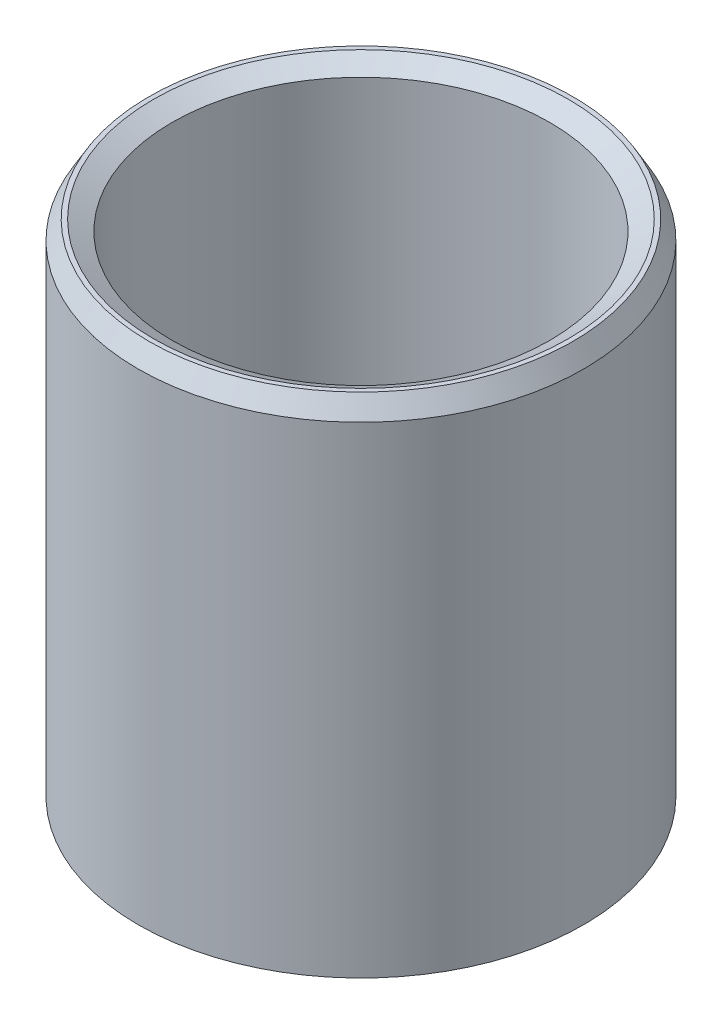
ISO-10303-21;
HEADER;
FILE_DESCRIPTION(('STEP AP214'),'2;1');
FILE_NAME('part.step','',(''),(''),'','','');
FILE_SCHEMA(('AUTOMOTIVE_DESIGN { 1 0 10303 214 1 1 1 1 }'));
ENDSEC;
DATA;
#1=APPLICATION_CONTEXT('core data for automotive mechanical design processes');
#2=APPLICATION_PROTOCOL_DEFINITION('international standard','automotive_design',2000,#1);
#3=PRODUCT_CONTEXT('',#1,'mechanical');
#4=PRODUCT('Part','Part','',(#3));
#5=PRODUCT_RELATED_PRODUCT_CATEGORY('part','',(#4));
#6=PRODUCT_DEFINITION_FORMATION('','',#4);
#7=PRODUCT_DEFINITION_CONTEXT('part definition',#1,'design');
#8=PRODUCT_DEFINITION('design','',#6,#7);
#9=PRODUCT_DEFINITION_SHAPE('','',#8);
#10=(LENGTH_UNIT() NAMED_UNIT(*) SI_UNIT(.MILLI.,.METRE.));
#11=(NAMED_UNIT(*) PLANE_ANGLE_UNIT() SI_UNIT($,.RADIAN.));
#12=(NAMED_UNIT(*) SI_UNIT($,.STERADIAN.) SOLID_ANGLE_UNIT());
#13=UNCERTAINTY_MEASURE_WITH_UNIT(LENGTH_MEASURE(1.E-05),#10,'distance_accuracy_value','');
#14=(GEOMETRIC_REPRESENTATION_CONTEXT(3) GLOBAL_UNCERTAINTY_ASSIGNED_CONTEXT((#13)) GLOBAL_UNIT_ASSIGNED_CONTEXT((#10,
#11,#12)) REPRESENTATION_CONTEXT('',''));
#15=CARTESIAN_POINT('',(0.,0.,0.));
#16=DIRECTION('',(0.,0.,1.));
#17=DIRECTION('',(1.,0.,0.));
#18=AXIS2_PLACEMENT_3D('',#15,#16,#17);
#19=CARTESIAN_POINT('',(0.,97.4390811008619,0.));
#20=DIRECTION('',(0.,-1.,0.));
#21=DIRECTION('',(0.,0.,-1.));
#22=AXIS2_PLACEMENT_3D('',#19,#20,#21);
#23=CYLINDRICAL_SURFACE('',#22,42.5);
#24=CARTESIAN_POINT('',(0.,2.04772689458219,0.));
#25=DIRECTION('',(0.,1.,0.));
#26=DIRECTION('',(0.,0.,1.));
#27=AXIS2_PLACEMENT_3D('',#24,#25,#26);
#28=CIRCLE('',#27,42.5);
#29=CARTESIAN_POINT('',(0.,2.04772689458219,42.5));
#30=VERTEX_POINT('',#29);
#31=EDGE_CURVE('E10',#30,#30,#28,.T.);
#32=ORIENTED_EDGE('',*,*,#31,.T.);
#33=EDGE_LOOP('',(#32));
#34=FACE_BOUND('',#33,.T.);
#35=CARTESIAN_POINT('',(0.,93.8923140794203,0.));
#36=DIRECTION('',(0.,1.,0.));
#37=DIRECTION('',(0.,0.,1.));
#38=AXIS2_PLACEMENT_3D('',#35,#36,#37);
#39=CIRCLE('',#38,42.5);
#40=CARTESIAN_POINT('',(0.,93.8923140794203,42.5));
#41=VERTEX_POINT('',#40);
#42=EDGE_CURVE('E50',#41,#41,#39,.F.);
#43=ORIENTED_EDGE('',*,*,#42,.T.);
#44=EDGE_LOOP('',(#43));
#45=FACE_BOUND('',#44,.T.);
#46=ADVANCED_FACE('F39',(#34,#45),#23,.T.);
#47=CARTESIAN_POINT('',(0.,97.4390811008619,0.));
#48=DIRECTION('',(0.,1.,0.));
#49=DIRECTION('',(0.,0.,1.));
#50=AXIS2_PLACEMENT_3D('',#47,#48,#49);
#51=PLANE('',#50);
#52=CARTESIAN_POINT('',(0.,97.4390811008619,0.));
#53=DIRECTION('',(0.,1.,0.));
#54=DIRECTION('',(0.,0.,1.));
#55=AXIS2_PLACEMENT_3D('',#52,#53,#54);
#56=CIRCLE('',#55,39.5839253291137);
#57=CARTESIAN_POINT('',(0.,97.4390811008619,39.5839253291137));
#58=VERTEX_POINT('',#57);
#59=EDGE_CURVE('E58',#58,#58,#56,.F.);
#60=ORIENTED_EDGE('',*,*,#59,.T.);
#61=EDGE_LOOP('',(#60));
#62=FACE_BOUND('',#61,.T.);
#63=CARTESIAN_POINT('',(0.,97.4390811008619,0.));
#64=DIRECTION('',(0.,1.,0.));
#65=DIRECTION('',(0.,0.,1.));
#66=AXIS2_PLACEMENT_3D('',#63,#64,#65);
#67=CIRCLE('',#66,40.4522731054179);
#68=CARTESIAN_POINT('',(0.,97.4390811008619,40.4522731054179));
#69=VERTEX_POINT('',#68);
#70=EDGE_CURVE('E61',#69,#69,#67,.T.);
#71=ORIENTED_EDGE('',*,*,#70,.T.);
#72=EDGE_LOOP('',(#71));
#73=FACE_BOUND('',#72,.T.);
#74=ADVANCED_FACE('F88',(#62,#73),#51,.T.);
#75=CARTESIAN_POINT('',(0.,0.,0.));
#76=DIRECTION('',(0.,1.,0.));
#77=DIRECTION('',(0.,0.,1.));
#78=AXIS2_PLACEMENT_3D('',#75,#76,#77);
#79=PLANE('',#78);
#80=CARTESIAN_POINT('',(0.,0.,0.));
#81=DIRECTION('',(0.,1.,0.));
#82=DIRECTION('',(0.,0.,1.));
#83=AXIS2_PLACEMENT_3D('',#80,#81,#82);
#84=CIRCLE('',#83,38.0848852022543);
#85=CARTESIAN_POINT('',(0.,0.,38.0848852022543));
#86=VERTEX_POINT('',#85);
#87=EDGE_CURVE('E51',#86,#86,#84,.T.);
#88=ORIENTED_EDGE('',*,*,#87,.T.);
#89=EDGE_LOOP('',(#88));
#90=FACE_BOUND('',#89,.T.);
#91=CARTESIAN_POINT('',(0.,0.,0.));
#92=DIRECTION('',(0.,1.,0.));
#93=DIRECTION('',(0.,0.,1.));
#94=AXIS2_PLACEMENT_3D('',#91,#92,#93);
#95=CIRCLE('',#94,38.9532329785584);
#96=CARTESIAN_POINT('',(0.,0.,38.9532329785584));
#97=VERTEX_POINT('',#96);
#98=EDGE_CURVE('E54',#97,#97,#95,.F.);
#99=ORIENTED_EDGE('',*,*,#98,.T.);
#100=EDGE_LOOP('',(#99));
#101=FACE_BOUND('',#100,.T.);
#102=ADVANCED_FACE('F83',(#90,#101),#79,.F.);
#103=CARTESIAN_POINT('',(0.,97.4390811008619,0.));
#104=DIRECTION('',(0.,-1.,0.));
#105=DIRECTION('',(0.,0.,-1.));
#106=AXIS2_PLACEMENT_3D('',#103,#104,#105);
#107=CYLINDRICAL_SURFACE('',#106,36.0371583076721);
#108=CARTESIAN_POINT('',(0.,95.3913542062798,0.));
#109=DIRECTION('',(0.,1.,0.));
#110=DIRECTION('',(0.,0.,1.));
#111=AXIS2_PLACEMENT_3D('',#108,#109,#110);
#112=CIRCLE('',#111,36.0371583076721);
#113=CARTESIAN_POINT('',(0.,95.3913542062798,36.0371583076721));
#114=VERTEX_POINT('',#113);
#115=EDGE_CURVE('E67',#114,#114,#112,.T.);
#116=ORIENTED_EDGE('',*,*,#115,.T.);
#117=EDGE_LOOP('',(#116));
#118=FACE_BOUND('',#117,.T.);
#119=CARTESIAN_POINT('',(0.,3.5467670214416,0.));
#120=DIRECTION('',(0.,1.,0.));
#121=DIRECTION('',(0.,0.,1.));
#122=AXIS2_PLACEMENT_3D('',#119,#120,#121);
#123=CIRCLE('',#122,36.0371583076721);
#124=CARTESIAN_POINT('',(0.,3.5467670214416,36.0371583076721));
#125=VERTEX_POINT('',#124);
#126=EDGE_CURVE('E69',#125,#125,#123,.F.);
#127=ORIENTED_EDGE('',*,*,#126,.T.);
#128=EDGE_LOOP('',(#127));
#129=FACE_BOUND('',#128,.T.);
#130=ADVANCED_FACE('F71',(#118,#129),#107,.F.);
#131=CARTESIAN_POINT('',(0.,95.3913542062798,0.));
#132=DIRECTION('',(0.,1.,0.));
#133=DIRECTION('',(0.,0.,1.));
#134=AXIS2_PLACEMENT_3D('',#131,#132,#133);
#135=CONICAL_SURFACE('',#134,36.0371583076721,1.0471975511966);
#136=ORIENTED_EDGE('',*,*,#59,.F.);
#137=EDGE_LOOP('',(#136));
#138=FACE_BOUND('',#137,.T.);
#139=ORIENTED_EDGE('',*,*,#115,.F.);
#140=EDGE_LOOP('',(#139));
#141=FACE_BOUND('',#140,.T.);
#142=ADVANCED_FACE('F77',(#138,#141),#135,.F.);
#143=CARTESIAN_POINT('',(0.,0.,0.));
#144=DIRECTION('',(0.,-1.,0.));
#145=DIRECTION('',(0.,0.,-1.));
#146=AXIS2_PLACEMENT_3D('',#143,#144,#145);
#147=CONICAL_SURFACE('',#146,38.0848852022543,0.523598775598295);
#148=ORIENTED_EDGE('',*,*,#126,.F.);
#149=EDGE_LOOP('',(#148));
#150=FACE_BOUND('',#149,.T.);
#151=ORIENTED_EDGE('',*,*,#87,.F.);
#152=EDGE_LOOP('',(#151));
#153=FACE_BOUND('',#152,.T.);
#154=ADVANCED_FACE('F73',(#150,#153),#147,.F.);
#155=CARTESIAN_POINT('',(0.,2.04772689458219,0.));
#156=DIRECTION('',(0.,1.,0.));
#157=DIRECTION('',(0.,0.,1.));
#158=AXIS2_PLACEMENT_3D('',#155,#156,#157);
#159=CONICAL_SURFACE('',#158,42.5,1.0471975511966);
#160=ORIENTED_EDGE('',*,*,#98,.F.);
#161=EDGE_LOOP('',(#160));
#162=FACE_BOUND('',#161,.T.);
#163=ORIENTED_EDGE('',*,*,#31,.F.);
#164=EDGE_LOOP('',(#163));
#165=FACE_BOUND('',#164,.T.);
#166=ADVANCED_FACE('F76',(#162,#165),#159,.T.);
#167=CARTESIAN_POINT('',(0.,97.4390811008619,0.));
#168=DIRECTION('',(0.,-1.,0.));
#169=DIRECTION('',(0.,0.,-1.));
#170=AXIS2_PLACEMENT_3D('',#167,#168,#169);
#171=CONICAL_SURFACE('',#170,40.4522731054179,0.523598775598294);
#172=ORIENTED_EDGE('',*,*,#42,.F.);
#173=EDGE_LOOP('',(#172));
#174=FACE_BOUND('',#173,.T.);
#175=ORIENTED_EDGE('',*,*,#70,.F.);
#176=EDGE_LOOP('',(#175));
#177=FACE_BOUND('',#176,.T.);
#178=ADVANCED_FACE('F45',(#174,#177),#171,.T.);
#179=CLOSED_SHELL('',(#46,#74,#102,#130,#142,#154,#166,#178));
#180=MANIFOLD_SOLID_BREP('B2',#179);
#181=ADVANCED_BREP_SHAPE_REPRESENTATION('',(#18,#180),#14);
#182=SHAPE_DEFINITION_REPRESENTATION(#9,#181);
ENDSEC;
END-ISO-10303-21;
